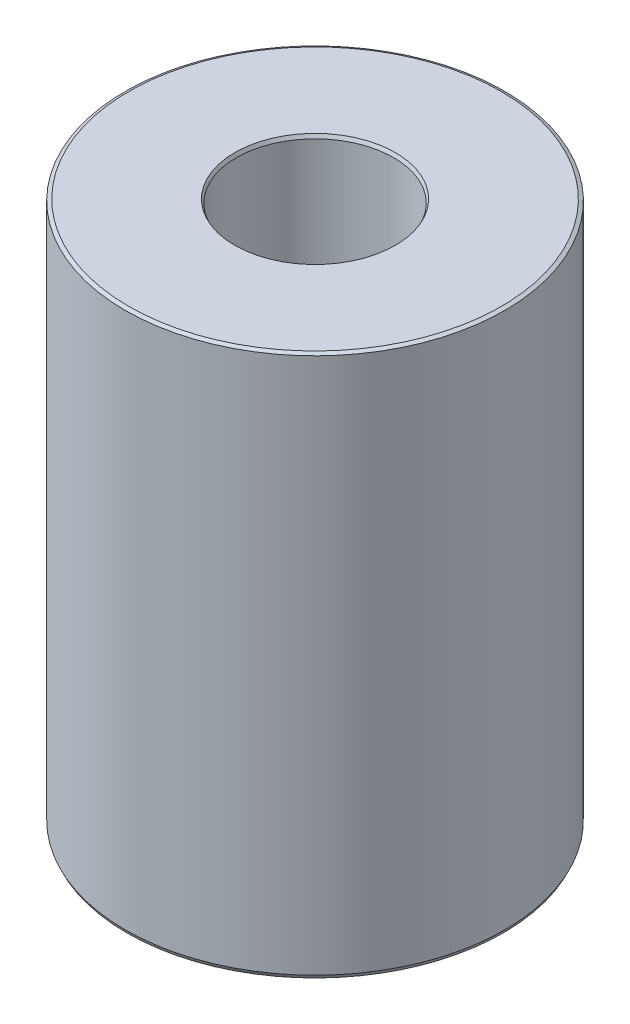
ISO-10303-21;
HEADER;
FILE_DESCRIPTION(('STEP AP214'),'2;1');
FILE_NAME('part.step','',(''),(''),'','','');
FILE_SCHEMA(('AUTOMOTIVE_DESIGN { 1 0 10303 214 1 1 1 1 }'));
ENDSEC;
DATA;
#1=APPLICATION_CONTEXT('core data for automotive mechanical design processes');
#2=APPLICATION_PROTOCOL_DEFINITION('international standard','automotive_design',2000,#1);
#3=PRODUCT_CONTEXT('',#1,'mechanical');
#4=PRODUCT('Part','Part','',(#3));
#5=PRODUCT_RELATED_PRODUCT_CATEGORY('part','',(#4));
#6=PRODUCT_DEFINITION_FORMATION('','',#4);
#7=PRODUCT_DEFINITION_CONTEXT('part definition',#1,'design');
#8=PRODUCT_DEFINITION('design','',#6,#7);
#9=PRODUCT_DEFINITION_SHAPE('','',#8);
#10=(LENGTH_UNIT() NAMED_UNIT(*) SI_UNIT(.MILLI.,.METRE.));
#11=(NAMED_UNIT(*) PLANE_ANGLE_UNIT() SI_UNIT($,.RADIAN.));
#12=(NAMED_UNIT(*) SI_UNIT($,.STERADIAN.) SOLID_ANGLE_UNIT());
#13=UNCERTAINTY_MEASURE_WITH_UNIT(LENGTH_MEASURE(1.E-05),#10,'distance_accuracy_value','');
#14=(GEOMETRIC_REPRESENTATION_CONTEXT(3) GLOBAL_UNCERTAINTY_ASSIGNED_CONTEXT((#13)) GLOBAL_UNIT_ASSIGNED_CONTEXT((#10,
#11,#12)) REPRESENTATION_CONTEXT('',''));
#15=CARTESIAN_POINT('',(0.,0.,0.));
#16=DIRECTION('',(0.,0.,1.));
#17=DIRECTION('',(1.,0.,0.));
#18=AXIS2_PLACEMENT_3D('',#15,#16,#17);
#19=CARTESIAN_POINT('',(0.,92.7689737879586,0.));
#20=DIRECTION('',(0.,-1.,0.));
#21=DIRECTION('',(0.,0.,-1.));
#22=AXIS2_PLACEMENT_3D('',#19,#20,#21);
#23=CYLINDRICAL_SURFACE('',#22,32.5);
#24=CARTESIAN_POINT('',(0.,0.609343687558841,0.));
#25=DIRECTION('',(0.,1.,0.));
#26=DIRECTION('',(0.,0.,1.));
#27=AXIS2_PLACEMENT_3D('',#24,#25,#26);
#28=CIRCLE('',#27,32.5);
#29=CARTESIAN_POINT('',(0.,0.609343687558841,32.5));
#30=VERTEX_POINT('',#29);
#31=EDGE_CURVE('E10',#30,#30,#28,.T.);
#32=ORIENTED_EDGE('',*,*,#31,.T.);
#33=EDGE_LOOP('',(#32));
#34=FACE_BOUND('',#33,.T.);
#35=CARTESIAN_POINT('',(0.,92.483874563731,0.));
#36=DIRECTION('',(0.,1.,0.));
#37=DIRECTION('',(0.,0.,1.));
#38=AXIS2_PLACEMENT_3D('',#35,#36,#37);
#39=CIRCLE('',#38,32.5);
#40=CARTESIAN_POINT('',(0.,92.483874563731,32.5));
#41=VERTEX_POINT('',#40);
#42=EDGE_CURVE('E50',#41,#41,#39,.F.);
#43=ORIENTED_EDGE('',*,*,#42,.T.);
#44=EDGE_LOOP('',(#43));
#45=FACE_BOUND('',#44,.T.);
#46=ADVANCED_FACE('F39',(#34,#45),#23,.T.);
#47=CARTESIAN_POINT('',(0.,92.7689737879586,0.));
#48=DIRECTION('',(0.,1.,0.));
#49=DIRECTION('',(0.,0.,1.));
#50=AXIS2_PLACEMENT_3D('',#47,#48,#49);
#51=PLANE('',#50);
#52=CARTESIAN_POINT('',(0.,92.7689737879586,0.));
#53=DIRECTION('',(0.,1.,0.));
#54=DIRECTION('',(0.,0.,1.));
#55=AXIS2_PLACEMENT_3D('',#52,#53,#54);
#56=CIRCLE('',#55,13.7616683727281);
#57=CARTESIAN_POINT('',(0.,92.7689737879586,13.7616683727281));
#58=VERTEX_POINT('',#57);
#59=EDGE_CURVE('E58',#58,#58,#56,.F.);
#60=ORIENTED_EDGE('',*,*,#59,.T.);
#61=EDGE_LOOP('',(#60));
#62=FACE_BOUND('',#61,.T.);
#63=CARTESIAN_POINT('',(0.,92.7689737879586,0.));
#64=DIRECTION('',(0.,1.,0.));
#65=DIRECTION('',(0.,0.,1.));
#66=AXIS2_PLACEMENT_3D('',#63,#64,#65);
#67=CIRCLE('',#66,31.8906563124411);
#68=CARTESIAN_POINT('',(0.,92.7689737879586,31.8906563124411));
#69=VERTEX_POINT('',#68);
#70=EDGE_CURVE('E61',#69,#69,#67,.T.);
#71=ORIENTED_EDGE('',*,*,#70,.T.);
#72=EDGE_LOOP('',(#71));
#73=FACE_BOUND('',#72,.T.);
#74=ADVANCED_FACE('F88',(#62,#73),#51,.T.);
#75=CARTESIAN_POINT('',(0.,0.,0.));
#76=DIRECTION('',(0.,1.,0.));
#77=DIRECTION('',(0.,0.,1.));
#78=AXIS2_PLACEMENT_3D('',#75,#76,#77);
#79=PLANE('',#78);
#80=CARTESIAN_POINT('',(0.,0.,0.));
#81=DIRECTION('',(0.,1.,0.));
#82=DIRECTION('',(0.,0.,1.));
#83=AXIS2_PLACEMENT_3D('',#80,#81,#82);
#84=CIRCLE('',#83,14.0859128360594);
#85=CARTESIAN_POINT('',(0.,0.,14.0859128360594));
#86=VERTEX_POINT('',#85);
#87=EDGE_CURVE('E51',#86,#86,#84,.T.);
#88=ORIENTED_EDGE('',*,*,#87,.T.);
#89=EDGE_LOOP('',(#88));
#90=FACE_BOUND('',#89,.T.);
#91=CARTESIAN_POINT('',(0.,0.,0.));
#92=DIRECTION('',(0.,1.,0.));
#93=DIRECTION('',(0.,0.,1.));
#94=AXIS2_PLACEMENT_3D('',#91,#92,#93);
#95=CIRCLE('',#94,32.2149007757724);
#96=CARTESIAN_POINT('',(0.,0.,32.2149007757724));
#97=VERTEX_POINT('',#96);
#98=EDGE_CURVE('E54',#97,#97,#95,.F.);
#99=ORIENTED_EDGE('',*,*,#98,.T.);
#100=EDGE_LOOP('',(#99));
#101=FACE_BOUND('',#100,.T.);
#102=ADVANCED_FACE('F83',(#90,#101),#79,.F.);
#103=CARTESIAN_POINT('',(0.,92.7689737879586,0.));
#104=DIRECTION('',(0.,-1.,0.));
#105=DIRECTION('',(0.,0.,-1.));
#106=AXIS2_PLACEMENT_3D('',#103,#104,#105);
#107=CYLINDRICAL_SURFACE('',#106,13.4765691485006);
#108=CARTESIAN_POINT('',(0.,92.1596301003998,0.));
#109=DIRECTION('',(0.,1.,0.));
#110=DIRECTION('',(0.,0.,1.));
#111=AXIS2_PLACEMENT_3D('',#108,#109,#110);
#112=CIRCLE('',#111,13.4765691485006);
#113=CARTESIAN_POINT('',(0.,92.1596301003997,13.4765691485006));
#114=VERTEX_POINT('',#113);
#115=EDGE_CURVE('E67',#114,#114,#112,.T.);
#116=ORIENTED_EDGE('',*,*,#115,.T.);
#117=EDGE_LOOP('',(#116));
#118=FACE_BOUND('',#117,.T.);
#119=CARTESIAN_POINT('',(0.,0.28509922422755,0.));
#120=DIRECTION('',(0.,1.,0.));
#121=DIRECTION('',(0.,0.,1.));
#122=AXIS2_PLACEMENT_3D('',#119,#120,#121);
#123=CIRCLE('',#122,13.4765691485006);
#124=CARTESIAN_POINT('',(0.,0.28509922422755,13.4765691485006));
#125=VERTEX_POINT('',#124);
#126=EDGE_CURVE('E69',#125,#125,#123,.F.);
#127=ORIENTED_EDGE('',*,*,#126,.T.);
#128=EDGE_LOOP('',(#127));
#129=FACE_BOUND('',#128,.T.);
#130=ADVANCED_FACE('F71',(#118,#129),#107,.F.);
#131=CARTESIAN_POINT('',(0.,92.1596301003998,0.));
#132=DIRECTION('',(0.,1.,0.));
#133=DIRECTION('',(0.,0.,1.));
#134=AXIS2_PLACEMENT_3D('',#131,#132,#133);
#135=CONICAL_SURFACE('',#134,13.4765691485006,0.437622373197244);
#136=CARTESIAN_POINT('',(0.,92.7689737879586,13.7616683727281));
#137=CARTESIAN_POINT('',(0.,92.7626264578799,13.7586985891424));
#138=CARTESIAN_POINT('',(0.,92.7562791278011,13.7557288055567));
#139=CARTESIAN_POINT('',(0.,92.7435844676436,13.7497892383853));
#140=CARTESIAN_POINT('',(0.,92.7372371375649,13.7468194547996));
#141=CARTESIAN_POINT('',(0.,92.7245424774074,13.7408798876282));
#142=CARTESIAN_POINT('',(0.,92.7181951473287,13.7379101040425));
#143=CARTESIAN_POINT('',(0.,92.7055004871712,13.7319705368711));
#144=CARTESIAN_POINT('',(0.,92.6991531570925,13.7290007532854));
#145=CARTESIAN_POINT('',(0.,92.686458496935,13.723061186114));
#146=CARTESIAN_POINT('',(0.,92.6801111668563,13.7200914025283));
#147=CARTESIAN_POINT('',(0.,92.6674165066988,13.7141518353569));
#148=CARTESIAN_POINT('',(0.,92.66106917662,13.7111820517712));
#149=CARTESIAN_POINT('',(0.,92.6483745164626,13.7052424845998));
#150=CARTESIAN_POINT('',(0.,92.6420271863838,13.7022727010141));
#151=CARTESIAN_POINT('',(0.,92.6293325262264,13.6963331338427));
#152=CARTESIAN_POINT('',(0.,92.6229851961476,13.693363350257));
#153=CARTESIAN_POINT('',(0.,92.6102905359902,13.6874237830855));
#154=CARTESIAN_POINT('',(0.,92.6039432059114,13.6844539994998));
#155=CARTESIAN_POINT('',(0.,92.5912485457539,13.6785144323284));
#156=CARTESIAN_POINT('',(0.,92.5849012156752,13.6755446487427));
#157=CARTESIAN_POINT('',(0.,92.5722065555177,13.6696050815713));
#158=CARTESIAN_POINT('',(0.,92.565859225439,13.6666352979856));
#159=CARTESIAN_POINT('',(0.,92.5531645652815,13.6606957308142));
#160=CARTESIAN_POINT('',(0.,92.5468172352028,13.6577259472285));
#161=CARTESIAN_POINT('',(0.,92.5341225750453,13.6517863800571));
#162=CARTESIAN_POINT('',(0.,92.5277752449665,13.6488165964714));
#163=CARTESIAN_POINT('',(0.,92.5150805848091,13.6428770293));
#164=CARTESIAN_POINT('',(0.,92.5087332547303,13.6399072457143));
#165=CARTESIAN_POINT('',(0.,92.4960385945729,13.6339676785429));
#166=CARTESIAN_POINT('',(0.,92.4896912644941,13.6309978949572));
#167=CARTESIAN_POINT('',(0.,92.4769966043367,13.6250583277858));
#168=CARTESIAN_POINT('',(0.,92.4706492742579,13.6220885442001));
#169=CARTESIAN_POINT('',(0.,92.4579546141004,13.6161489770287));
#170=CARTESIAN_POINT('',(0.,92.4516072840217,13.613179193443));
#171=CARTESIAN_POINT('',(0.,92.4389126238642,13.6072396262715));
#172=CARTESIAN_POINT('',(0.,92.4325652937855,13.6042698426858));
#173=CARTESIAN_POINT('',(0.,92.419870633628,13.5983302755144));
#174=CARTESIAN_POINT('',(0.,92.4135233035493,13.5953604919287));
#175=CARTESIAN_POINT('',(0.,92.4008286433918,13.5894209247573));
#176=CARTESIAN_POINT('',(0.,92.3944813133131,13.5864511411716));
#177=CARTESIAN_POINT('',(0.,92.3817866531556,13.5805115740002));
#178=CARTESIAN_POINT('',(0.,92.3754393230768,13.5775417904145));
#179=CARTESIAN_POINT('',(0.,92.3627446629194,13.5716022232431));
#180=CARTESIAN_POINT('',(0.,92.3563973328406,13.5686324396574));
#181=CARTESIAN_POINT('',(0.,92.3437026726832,13.562692872486));
#182=CARTESIAN_POINT('',(0.,92.3373553426044,13.5597230889003));
#183=CARTESIAN_POINT('',(0.,92.3246606824469,13.5537835217289));
#184=CARTESIAN_POINT('',(0.,92.3183133523682,13.5508137381432));
#185=CARTESIAN_POINT('',(0.,92.3056186922107,13.5448741709718));
#186=CARTESIAN_POINT('',(0.,92.299271362132,13.5419043873861));
#187=CARTESIAN_POINT('',(0.,92.2865767019745,13.5359648202147));
#188=CARTESIAN_POINT('',(0.,92.2802293718958,13.532995036629));
#189=CARTESIAN_POINT('',(0.,92.2675347117383,13.5270554694575));
#190=CARTESIAN_POINT('',(0.,92.2611873816595,13.5240856858718));
#191=CARTESIAN_POINT('',(0.,92.2484927215021,13.5181461187004));
#192=CARTESIAN_POINT('',(0.,92.2421453914233,13.5151763351147));
#193=CARTESIAN_POINT('',(0.,92.2294507312659,13.5092367679433));
#194=CARTESIAN_POINT('',(0.,92.2231034011871,13.5062669843576));
#195=CARTESIAN_POINT('',(0.,92.2104087410297,13.5003274171862));
#196=CARTESIAN_POINT('',(0.,92.2040614109509,13.4973576336005));
#197=CARTESIAN_POINT('',(0.,92.1913667507934,13.4914180664291));
#198=CARTESIAN_POINT('',(0.,92.1850194207147,13.4884482828434));
#199=CARTESIAN_POINT('',(0.,92.1723247605572,13.482508715672));
#200=CARTESIAN_POINT('',(0.,92.1659774304785,13.4795389320863));
#201=CARTESIAN_POINT('',(0.,92.1596301003998,13.4765691485006));
#202=B_SPLINE_CURVE_WITH_KNOTS('',3,(#136,#137,#138,#139,#140,#141,#142,#143,#144,#145,#146,
#147,#148,#149,#150,#151,#152,#153,#154,#155,#156,#157,#158,#159,#160,#161,#162,#163,#164,#165,
#166,#167,#168,#169,#170,#171,#172,#173,#174,#175,#176,#177,#178,#179,#180,#181,#182,#183,#184,
#185,#186,#187,#188,#189,#190,#191,#192,#193,#194,#195,#196,#197,#198,#199,#200,#201),
.UNSPECIFIED.,.F.,.F.,(4,2,2,2,2,2,2,2,2,2,2,2,2,2,2,2,2,2,2,2,2,2,2,2,2,2,2,2,2,2,2,2,4),(0.,
0.0210231758559373,0.0420463517118621,0.0630695275677876,0.084092703423725,0.10511587927965,
0.126139055135575,0.147162230991513,0.168185406847438,0.189208582703363,0.2102317585593,
0.231254934415226,0.252278110271151,0.273301286127088,0.294324461983013,0.315347637838938,
0.336370813694863,0.357393989550801,0.378417165406726,0.399440341262651,0.420463517118589,
0.441486692974513,0.462509868830438,0.483533044686376,0.504556220542301,0.525579396398226,
0.546602572254164,0.567625748110089,0.588648923966014,0.609672099821952,0.630695275677877,
0.651718451533802,0.672741627389727),.UNSPECIFIED.);
#203=EDGE_CURVE('BSEAM77',#58,#114,#202,.T.);
#204=ORIENTED_EDGE('',*,*,#59,.F.);
#205=ORIENTED_EDGE('',*,*,#115,.F.);
#206=ORIENTED_EDGE('',*,*,#203,.T.);
#207=ORIENTED_EDGE('',*,*,#203,.F.);
#208=EDGE_LOOP('',(#204,#206,#205,#207));
#209=FACE_BOUND('',#208,.T.);
#210=ADVANCED_FACE('F77',(#209),#135,.F.);
#211=CARTESIAN_POINT('',(0.,0.,0.));
#212=DIRECTION('',(0.,-1.,0.));
#213=DIRECTION('',(0.,0.,-1.));
#214=AXIS2_PLACEMENT_3D('',#211,#212,#213);
#215=CONICAL_SURFACE('',#214,14.0859128360594,1.13317395359764);
#216=ORIENTED_EDGE('',*,*,#126,.F.);
#217=EDGE_LOOP('',(#216));
#218=FACE_BOUND('',#217,.T.);
#219=ORIENTED_EDGE('',*,*,#87,.F.);
#220=EDGE_LOOP('',(#219));
#221=FACE_BOUND('',#220,.T.);
#222=ADVANCED_FACE('F73',(#218,#221),#215,.F.);
#223=CARTESIAN_POINT('',(0.,0.609343687558841,0.));
#224=DIRECTION('',(0.,1.,0.));
#225=DIRECTION('',(0.,0.,1.));
#226=AXIS2_PLACEMENT_3D('',#223,#224,#225);
#227=CONICAL_SURFACE('',#226,32.5,0.437622373197264);
#228=ORIENTED_EDGE('',*,*,#98,.F.);
#229=EDGE_LOOP('',(#228));
#230=FACE_BOUND('',#229,.T.);
#231=ORIENTED_EDGE('',*,*,#31,.F.);
#232=EDGE_LOOP('',(#231));
#233=FACE_BOUND('',#232,.T.);
#234=ADVANCED_FACE('F76',(#230,#233),#227,.T.);
#235=CARTESIAN_POINT('',(0.,92.7689737879586,0.));
#236=DIRECTION('',(0.,-1.,0.));
#237=DIRECTION('',(0.,0.,-1.));
#238=AXIS2_PLACEMENT_3D('',#235,#236,#237);
#239=CONICAL_SURFACE('',#238,31.8906563124411,1.13317395359766);
#240=ORIENTED_EDGE('',*,*,#42,.F.);
#241=EDGE_LOOP('',(#240));
#242=FACE_BOUND('',#241,.T.);
#243=ORIENTED_EDGE('',*,*,#70,.F.);
#244=EDGE_LOOP('',(#243));
#245=FACE_BOUND('',#244,.T.);
#246=ADVANCED_FACE('F45',(#242,#245),#239,.T.);
#247=CLOSED_SHELL('',(#46,#74,#102,#130,#210,#222,#234,#246));
#248=MANIFOLD_SOLID_BREP('B2',#247);
#249=ADVANCED_BREP_SHAPE_REPRESENTATION('',(#18,#248),#14);
#250=SHAPE_DEFINITION_REPRESENTATION(#9,#249);
ENDSEC;
END-ISO-10303-21;
